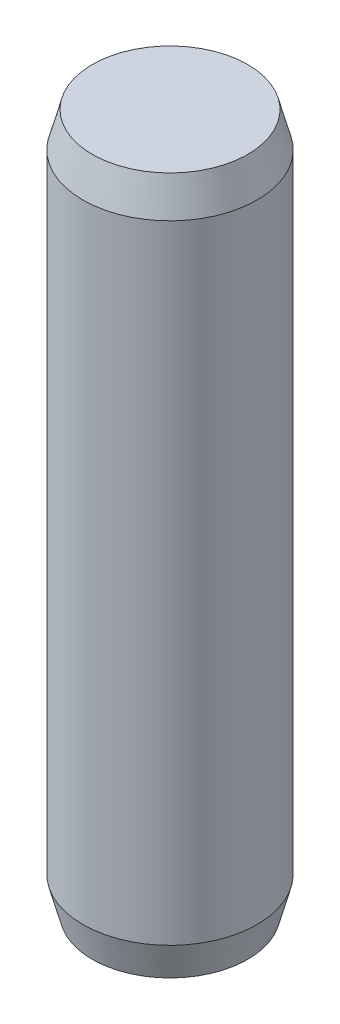
ISO-10303-21;
HEADER;
FILE_DESCRIPTION(('STEP AP214'),'2;1');
FILE_NAME('part.step','',(''),(''),'','','');
FILE_SCHEMA(('AUTOMOTIVE_DESIGN { 1 0 10303 214 1 1 1 1 }'));
ENDSEC;
DATA;
#1=APPLICATION_CONTEXT('core data for automotive mechanical design processes');
#2=APPLICATION_PROTOCOL_DEFINITION('international standard','automotive_design',2000,#1);
#3=PRODUCT_CONTEXT('',#1,'mechanical');
#4=PRODUCT('Part','Part','',(#3));
#5=PRODUCT_RELATED_PRODUCT_CATEGORY('part','',(#4));
#6=PRODUCT_DEFINITION_FORMATION('','',#4);
#7=PRODUCT_DEFINITION_CONTEXT('part definition',#1,'design');
#8=PRODUCT_DEFINITION('design','',#6,#7);
#9=PRODUCT_DEFINITION_SHAPE('','',#8);
#10=(LENGTH_UNIT() NAMED_UNIT(*) SI_UNIT(.MILLI.,.METRE.));
#11=(NAMED_UNIT(*) PLANE_ANGLE_UNIT() SI_UNIT($,.RADIAN.));
#12=(NAMED_UNIT(*) SI_UNIT($,.STERADIAN.) SOLID_ANGLE_UNIT());
#13=UNCERTAINTY_MEASURE_WITH_UNIT(LENGTH_MEASURE(1.E-05),#10,'distance_accuracy_value','');
#14=(GEOMETRIC_REPRESENTATION_CONTEXT(3) GLOBAL_UNCERTAINTY_ASSIGNED_CONTEXT((#13)) GLOBAL_UNIT_ASSIGNED_CONTEXT((#10,
#11,#12)) REPRESENTATION_CONTEXT('',''));
#15=CARTESIAN_POINT('',(0.,0.,0.));
#16=DIRECTION('',(0.,0.,1.));
#17=DIRECTION('',(1.,0.,0.));
#18=AXIS2_PLACEMENT_3D('',#15,#16,#17);
#19=CARTESIAN_POINT('',(0.,0.,0.));
#20=DIRECTION('',(0.,-1.,0.));
#21=DIRECTION('',(0.,0.,-1.));
#22=AXIS2_PLACEMENT_3D('',#19,#20,#21);
#23=PLANE('',#22);
#24=CARTESIAN_POINT('',(0.,0.,0.));
#25=DIRECTION('',(0.,-1.,0.));
#26=DIRECTION('',(0.,0.,-1.));
#27=AXIS2_PLACEMENT_3D('',#24,#25,#26);
#28=CIRCLE('',#27,2.67846096908265);
#29=CARTESIAN_POINT('',(0.,0.,-2.67846096908265));
#30=VERTEX_POINT('',#29);
#31=EDGE_CURVE('E45',#30,#30,#28,.T.);
#32=ORIENTED_EDGE('',*,*,#31,.T.);
#33=EDGE_LOOP('',(#32));
#34=FACE_BOUND('',#33,.T.);
#35=ADVANCED_FACE('F30',(#34),#23,.T.);
#36=CARTESIAN_POINT('',(0.,24.,0.));
#37=DIRECTION('',(0.,1.,0.));
#38=DIRECTION('',(0.,0.,1.));
#39=AXIS2_PLACEMENT_3D('',#36,#37,#38);
#40=PLANE('',#39);
#41=CARTESIAN_POINT('',(0.,24.,0.));
#42=DIRECTION('',(0.,1.,0.));
#43=DIRECTION('',(0.,0.,1.));
#44=AXIS2_PLACEMENT_3D('',#41,#42,#43);
#45=CIRCLE('',#44,2.67846096908265);
#46=CARTESIAN_POINT('',(0.,24.,-2.67846096908266));
#47=VERTEX_POINT('',#46);
#48=EDGE_CURVE('E10',#47,#47,#45,.T.);
#49=ORIENTED_EDGE('',*,*,#48,.T.);
#50=EDGE_LOOP('',(#49));
#51=FACE_BOUND('',#50,.T.);
#52=ADVANCED_FACE('F61',(#51),#40,.T.);
#53=CARTESIAN_POINT('',(0.,0.,0.));
#54=DIRECTION('',(0.,-1.,0.));
#55=DIRECTION('',(0.,0.,-1.));
#56=AXIS2_PLACEMENT_3D('',#53,#54,#55);
#57=CYLINDRICAL_SURFACE('',#56,3.);
#58=CARTESIAN_POINT('',(0.,22.8,0.));
#59=DIRECTION('',(0.,1.,0.));
#60=DIRECTION('',(0.,0.,1.));
#61=AXIS2_PLACEMENT_3D('',#58,#59,#60);
#62=CIRCLE('',#61,3.);
#63=CARTESIAN_POINT('',(0.,22.8,-3.));
#64=VERTEX_POINT('',#63);
#65=EDGE_CURVE('E37',#64,#64,#62,.F.);
#66=ORIENTED_EDGE('',*,*,#65,.T.);
#67=EDGE_LOOP('',(#66));
#68=FACE_BOUND('',#67,.T.);
#69=CARTESIAN_POINT('',(0.,1.20000000000001,0.));
#70=DIRECTION('',(0.,-1.,0.));
#71=DIRECTION('',(0.,0.,-1.));
#72=AXIS2_PLACEMENT_3D('',#69,#70,#71);
#73=CIRCLE('',#72,3.);
#74=CARTESIAN_POINT('',(0.,1.20000000000001,-3.));
#75=VERTEX_POINT('',#74);
#76=EDGE_CURVE('E41',#75,#75,#73,.F.);
#77=ORIENTED_EDGE('',*,*,#76,.T.);
#78=EDGE_LOOP('',(#77));
#79=FACE_BOUND('',#78,.T.);
#80=ADVANCED_FACE('F54',(#68,#79),#57,.T.);
#81=CARTESIAN_POINT('',(0.,0.,0.));
#82=DIRECTION('',(0.,1.,0.));
#83=DIRECTION('',(0.,0.,1.));
#84=AXIS2_PLACEMENT_3D('',#81,#82,#83);
#85=CONICAL_SURFACE('',#84,2.67846096908265,0.261799387799147);
#86=ORIENTED_EDGE('',*,*,#76,.F.);
#87=EDGE_LOOP('',(#86));
#88=FACE_BOUND('',#87,.T.);
#89=ORIENTED_EDGE('',*,*,#31,.F.);
#90=EDGE_LOOP('',(#89));
#91=FACE_BOUND('',#90,.T.);
#92=ADVANCED_FACE('F52',(#88,#91),#85,.T.);
#93=CARTESIAN_POINT('',(0.,22.8,0.));
#94=DIRECTION('',(0.,-1.,0.));
#95=DIRECTION('',(0.,0.,-1.));
#96=AXIS2_PLACEMENT_3D('',#93,#94,#95);
#97=CONICAL_SURFACE('',#96,3.,0.261799387799147);
#98=CARTESIAN_POINT('',(0.,24.,-2.67846096908266));
#99=CARTESIAN_POINT('',(0.,23.9875,-2.68181033398804));
#100=CARTESIAN_POINT('',(0.,23.975,-2.68515969889343));
#101=CARTESIAN_POINT('',(0.,23.95,-2.69185842870421));
#102=CARTESIAN_POINT('',(0.,23.9375,-2.6952077936096));
#103=CARTESIAN_POINT('',(0.,23.9125,-2.70190652342038));
#104=CARTESIAN_POINT('',(0.,23.9,-2.70525588832577));
#105=CARTESIAN_POINT('',(0.,23.875,-2.71195461813655));
#106=CARTESIAN_POINT('',(0.,23.8625,-2.71530398304193));
#107=CARTESIAN_POINT('',(0.,23.8375,-2.72200271285271));
#108=CARTESIAN_POINT('',(0.,23.825,-2.7253520777581));
#109=CARTESIAN_POINT('',(0.,23.8,-2.73205080756888));
#110=CARTESIAN_POINT('',(0.,23.7875,-2.73540017247427));
#111=CARTESIAN_POINT('',(0.,23.7625,-2.74209890228505));
#112=CARTESIAN_POINT('',(0.,23.75,-2.74544826719044));
#113=CARTESIAN_POINT('',(0.,23.725,-2.75214699700121));
#114=CARTESIAN_POINT('',(0.,23.7125,-2.7554963619066));
#115=CARTESIAN_POINT('',(0.,23.6875,-2.76219509171738));
#116=CARTESIAN_POINT('',(0.,23.675,-2.76554445662277));
#117=CARTESIAN_POINT('',(0.,23.65,-2.77224318643355));
#118=CARTESIAN_POINT('',(0.,23.6375,-2.77559255133894));
#119=CARTESIAN_POINT('',(0.,23.6125,-2.78229128114971));
#120=CARTESIAN_POINT('',(0.,23.6,-2.7856406460551));
#121=CARTESIAN_POINT('',(0.,23.575,-2.79233937586588));
#122=CARTESIAN_POINT('',(0.,23.5625,-2.79568874077127));
#123=CARTESIAN_POINT('',(0.,23.5375,-2.80238747058205));
#124=CARTESIAN_POINT('',(0.,23.525,-2.80573683548744));
#125=CARTESIAN_POINT('',(0.,23.5,-2.81243556529822));
#126=CARTESIAN_POINT('',(0.,23.4875,-2.8157849302036));
#127=CARTESIAN_POINT('',(0.,23.4625,-2.82248366001438));
#128=CARTESIAN_POINT('',(0.,23.45,-2.82583302491977));
#129=CARTESIAN_POINT('',(0.,23.425,-2.83253175473055));
#130=CARTESIAN_POINT('',(0.,23.4125,-2.83588111963594));
#131=CARTESIAN_POINT('',(0.,23.3875,-2.84257984944672));
#132=CARTESIAN_POINT('',(0.,23.375,-2.84592921435211));
#133=CARTESIAN_POINT('',(0.,23.35,-2.85262794416288));
#134=CARTESIAN_POINT('',(0.,23.3375,-2.85597730906827));
#135=CARTESIAN_POINT('',(0.,23.3125,-2.86267603887905));
#136=CARTESIAN_POINT('',(0.,23.3,-2.86602540378444));
#137=CARTESIAN_POINT('',(0.,23.275,-2.87272413359522));
#138=CARTESIAN_POINT('',(0.,23.2625,-2.87607349850061));
#139=CARTESIAN_POINT('',(0.,23.2375,-2.88277222831139));
#140=CARTESIAN_POINT('',(0.,23.225,-2.88612159321677));
#141=CARTESIAN_POINT('',(0.,23.2,-2.89282032302755));
#142=CARTESIAN_POINT('',(0.,23.1875,-2.89616968793294));
#143=CARTESIAN_POINT('',(0.,23.1625,-2.90286841774372));
#144=CARTESIAN_POINT('',(0.,23.15,-2.90621778264911));
#145=CARTESIAN_POINT('',(0.,23.125,-2.91291651245989));
#146=CARTESIAN_POINT('',(0.,23.1125,-2.91626587736528));
#147=CARTESIAN_POINT('',(0.,23.0875,-2.92296460717605));
#148=CARTESIAN_POINT('',(0.,23.075,-2.92631397208144));
#149=CARTESIAN_POINT('',(0.,23.05,-2.93301270189222));
#150=CARTESIAN_POINT('',(0.,23.0375,-2.93636206679761));
#151=CARTESIAN_POINT('',(0.,23.0125,-2.94306079660839));
#152=CARTESIAN_POINT('',(0.,23.,-2.94641016151378));
#153=CARTESIAN_POINT('',(0.,22.975,-2.95310889132455));
#154=CARTESIAN_POINT('',(0.,22.9625,-2.95645825622994));
#155=CARTESIAN_POINT('',(0.,22.9375,-2.96315698604072));
#156=CARTESIAN_POINT('',(0.,22.925,-2.96650635094611));
#157=CARTESIAN_POINT('',(0.,22.9,-2.97320508075689));
#158=CARTESIAN_POINT('',(0.,22.8875,-2.97655444566228));
#159=CARTESIAN_POINT('',(0.,22.8625,-2.98325317547306));
#160=CARTESIAN_POINT('',(0.,22.85,-2.98660254037844));
#161=CARTESIAN_POINT('',(0.,22.825,-2.99330127018922));
#162=CARTESIAN_POINT('',(0.,22.8125,-2.99665063509461));
#163=CARTESIAN_POINT('',(0.,22.8,-3.));
#164=B_SPLINE_CURVE_WITH_KNOTS('',3,(#98,#99,#100,#101,#102,#103,#104,#105,#106,#107,#108,#109,
#110,#111,#112,#113,#114,#115,#116,#117,#118,#119,#120,#121,#122,#123,#124,#125,#126,#127,#128,
#129,#130,#131,#132,#133,#134,#135,#136,#137,#138,#139,#140,#141,#142,#143,#144,#145,#146,#147,
#148,#149,#150,#151,#152,#153,#154,#155,#156,#157,#158,#159,#160,#161,#162,#163),.UNSPECIFIED.,
.F.,.F.,(4,2,2,2,2,2,2,2,2,2,2,2,2,2,2,2,2,2,2,2,2,2,2,2,2,2,2,2,2,2,2,2,4),(0.,
0.0388228567653775,0.077645713530755,0.116468570296132,0.15529142706151,0.194114283826891,
0.232937140592268,0.271759997357646,0.310582854123023,0.349405710888404,0.388228567653781,
0.427051424419159,0.465874281184536,0.504697137949914,0.543519994715295,0.582342851480672,
0.62116570824605,0.659988565011427,0.698811421776804,0.737634278542185,0.776457135307563,
0.81527999207294,0.854102848838318,0.892925705603699,0.931748562369076,0.970571419134453,
1.00939427589983,1.04821713266521,1.08703998943059,1.12586284619597,1.16468570296134,
1.20350855972672,1.2423314164921),.UNSPECIFIED.);
#165=EDGE_CURVE('BSEAM32',#47,#64,#164,.T.);
#166=ORIENTED_EDGE('',*,*,#48,.F.);
#167=ORIENTED_EDGE('',*,*,#65,.F.);
#168=ORIENTED_EDGE('',*,*,#165,.T.);
#169=ORIENTED_EDGE('',*,*,#165,.F.);
#170=EDGE_LOOP('',(#166,#168,#167,#169));
#171=FACE_BOUND('',#170,.T.);
#172=ADVANCED_FACE('F32',(#171),#97,.T.);
#173=CLOSED_SHELL('',(#35,#52,#80,#92,#172));
#174=MANIFOLD_SOLID_BREP('B2',#173);
#175=ADVANCED_BREP_SHAPE_REPRESENTATION('',(#18,#174),#14);
#176=SHAPE_DEFINITION_REPRESENTATION(#9,#175);
ENDSEC;
END-ISO-10303-21;
